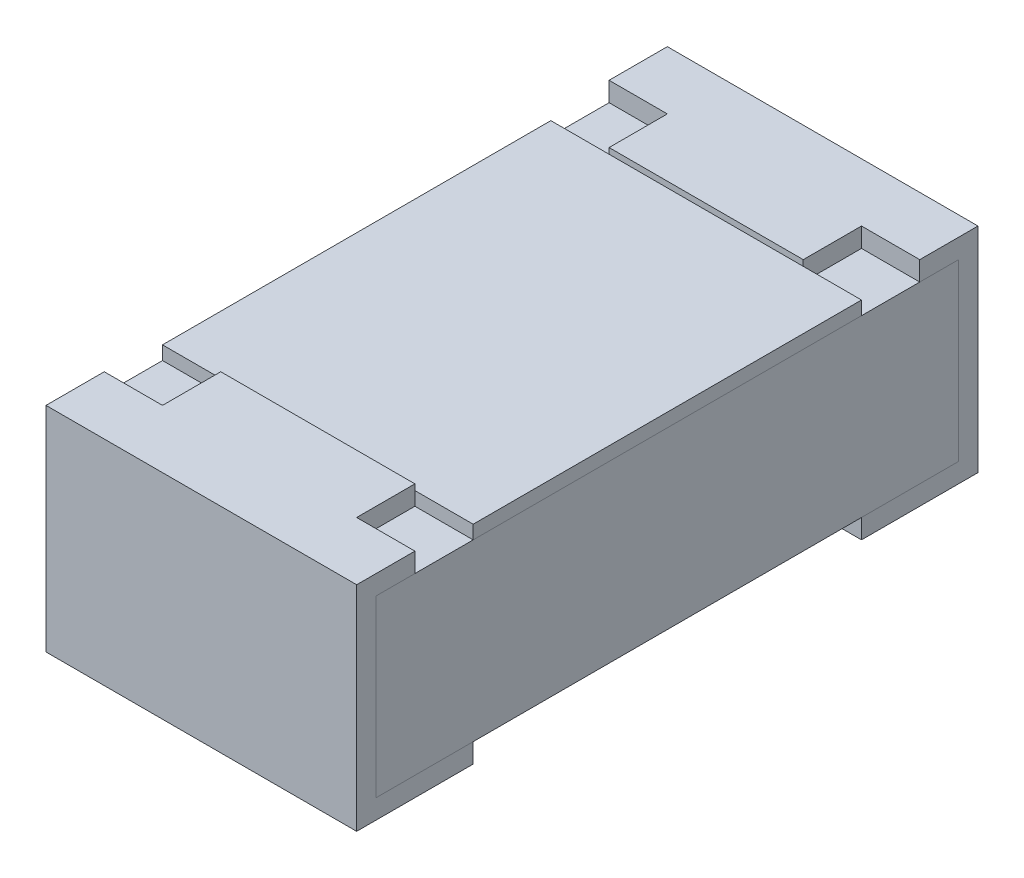
ISO-10303-21;
HEADER;
FILE_DESCRIPTION(('STEP AP214'),'2;1');
FILE_NAME('part.step','',(''),(''),'','','');
FILE_SCHEMA(('AUTOMOTIVE_DESIGN { 1 0 10303 214 1 1 1 1 }'));
ENDSEC;
DATA;
#1=APPLICATION_CONTEXT('core data for automotive mechanical design processes');
#2=APPLICATION_PROTOCOL_DEFINITION('international standard','automotive_design',2000,#1);
#3=PRODUCT_CONTEXT('',#1,'mechanical');
#4=PRODUCT('Part','Part','',(#3));
#5=PRODUCT_RELATED_PRODUCT_CATEGORY('part','',(#4));
#6=PRODUCT_DEFINITION_FORMATION('','',#4);
#7=PRODUCT_DEFINITION_CONTEXT('part definition',#1,'design');
#8=PRODUCT_DEFINITION('design','',#6,#7);
#9=PRODUCT_DEFINITION_SHAPE('','',#8);
#10=(LENGTH_UNIT() NAMED_UNIT(*) SI_UNIT(.MILLI.,.METRE.));
#11=(NAMED_UNIT(*) PLANE_ANGLE_UNIT() SI_UNIT($,.RADIAN.));
#12=(NAMED_UNIT(*) SI_UNIT($,.STERADIAN.) SOLID_ANGLE_UNIT());
#13=UNCERTAINTY_MEASURE_WITH_UNIT(LENGTH_MEASURE(1.E-05),#10,'distance_accuracy_value','');
#14=(GEOMETRIC_REPRESENTATION_CONTEXT(3) GLOBAL_UNCERTAINTY_ASSIGNED_CONTEXT((#13)) GLOBAL_UNIT_ASSIGNED_CONTEXT((#10,
#11,#12)) REPRESENTATION_CONTEXT('',''));
#15=CARTESIAN_POINT('',(0.,0.,0.));
#16=DIRECTION('',(0.,0.,1.));
#17=DIRECTION('',(1.,0.,0.));
#18=AXIS2_PLACEMENT_3D('',#15,#16,#17);
#19=CARTESIAN_POINT('',(-0.25,0.5,0.65));
#20=DIRECTION('',(1.,0.,0.));
#21=DIRECTION('',(0.,0.,-1.));
#22=AXIS2_PLACEMENT_3D('',#19,#20,#21);
#23=PLANE('',#22);
#24=DIRECTION('',(0.,0.,-1.));
#25=VECTOR('',#24,1.);
#26=CARTESIAN_POINT('',(-0.25,0.5,0.75));
#27=LINE('',#26,#25);
#28=CARTESIAN_POINT('',(-0.25,0.5,0.65));
#29=VERTEX_POINT('',#28);
#30=CARTESIAN_POINT('',(-0.25,0.5,0.5));
#31=VERTEX_POINT('',#30);
#32=EDGE_CURVE('P0_E110',#29,#31,#27,.T.);
#33=ORIENTED_EDGE('',*,*,#32,.F.);
#34=DIRECTION('',(0.,1.,0.));
#35=VECTOR('',#34,1.);
#36=CARTESIAN_POINT('',(-0.25,0.5,0.65));
#37=LINE('',#36,#35);
#38=CARTESIAN_POINT('',(-0.25,0.55,0.65));
#39=VERTEX_POINT('',#38);
#40=EDGE_CURVE('P0_E193',#29,#39,#37,.T.);
#41=ORIENTED_EDGE('',*,*,#40,.T.);
#42=DIRECTION('',(0.,0.,1.));
#43=VECTOR('',#42,1.);
#44=CARTESIAN_POINT('',(-0.25,0.55,0.5));
#45=LINE('',#44,#43);
#46=CARTESIAN_POINT('',(-0.25,0.55,0.5));
#47=VERTEX_POINT('',#46);
#48=EDGE_CURVE('P0_E113',#47,#39,#45,.T.);
#49=ORIENTED_EDGE('',*,*,#48,.F.);
#50=DIRECTION('',(0.,1.,0.));
#51=VECTOR('',#50,1.);
#52=CARTESIAN_POINT('',(-0.25,0.55,0.5));
#53=LINE('',#52,#51);
#54=EDGE_CURVE('P0_E108',#31,#47,#53,.T.);
#55=ORIENTED_EDGE('',*,*,#54,.F.);
#56=EDGE_LOOP('',(#33,#41,#49,#55));
#57=FACE_BOUND('',#56,.T.);
#58=ADVANCED_FACE('P0_F16',(#57),#23,.F.);
#59=CARTESIAN_POINT('',(0.4,0.5,0.65));
#60=DIRECTION('',(0.,0.,1.));
#61=DIRECTION('',(1.,0.,0.));
#62=AXIS2_PLACEMENT_3D('',#59,#60,#61);
#63=PLANE('',#62);
#64=DIRECTION('',(0.,1.,0.));
#65=VECTOR('',#64,1.);
#66=CARTESIAN_POINT('',(0.4,0.5,0.65));
#67=LINE('',#66,#65);
#68=CARTESIAN_POINT('',(0.4,0.5,0.65));
#69=VERTEX_POINT('',#68);
#70=CARTESIAN_POINT('',(0.4,0.55,0.65));
#71=VERTEX_POINT('',#70);
#72=EDGE_CURVE('P0_E189',#69,#71,#67,.T.);
#73=ORIENTED_EDGE('',*,*,#72,.F.);
#74=DIRECTION('',(1.,0.,0.));
#75=VECTOR('',#74,1.);
#76=CARTESIAN_POINT('',(-0.4,0.5,0.65));
#77=LINE('',#76,#75);
#78=CARTESIAN_POINT('',(0.25,0.5,0.65));
#79=VERTEX_POINT('',#78);
#80=EDGE_CURVE('P0_E199',#79,#69,#77,.T.);
#81=ORIENTED_EDGE('',*,*,#80,.F.);
#82=DIRECTION('',(0.,1.,0.));
#83=VECTOR('',#82,1.);
#84=CARTESIAN_POINT('',(0.25,0.5,0.65));
#85=LINE('',#84,#83);
#86=CARTESIAN_POINT('',(0.25,0.55,0.65));
#87=VERTEX_POINT('',#86);
#88=EDGE_CURVE('P0_E19',#79,#87,#85,.T.);
#89=ORIENTED_EDGE('',*,*,#88,.T.);
#90=DIRECTION('',(1.,0.,0.));
#91=VECTOR('',#90,1.);
#92=CARTESIAN_POINT('',(-0.4,0.55,0.65));
#93=LINE('',#92,#91);
#94=EDGE_CURVE('P0_E168',#71,#87,#93,.F.);
#95=ORIENTED_EDGE('',*,*,#94,.F.);
#96=EDGE_LOOP('',(#73,#81,#89,#95));
#97=FACE_BOUND('',#96,.T.);
#98=ADVANCED_FACE('P0_F208',(#97),#63,.F.);
#99=CARTESIAN_POINT('',(0.25,0.5,0.65));
#100=DIRECTION('',(-1.,0.,0.));
#101=DIRECTION('',(0.,0.,1.));
#102=AXIS2_PLACEMENT_3D('',#99,#100,#101);
#103=PLANE('',#102);
#104=DIRECTION('',(0.,0.,1.));
#105=VECTOR('',#104,1.);
#106=CARTESIAN_POINT('',(0.25,0.55,0.5));
#107=LINE('',#106,#105);
#108=CARTESIAN_POINT('',(0.25,0.55,0.5));
#109=VERTEX_POINT('',#108);
#110=EDGE_CURVE('P0_E165',#87,#109,#107,.F.);
#111=ORIENTED_EDGE('',*,*,#110,.F.);
#112=ORIENTED_EDGE('',*,*,#88,.F.);
#113=DIRECTION('',(0.,0.,-1.));
#114=VECTOR('',#113,1.);
#115=CARTESIAN_POINT('',(0.25,0.5,0.75));
#116=LINE('',#115,#114);
#117=CARTESIAN_POINT('',(0.25,0.5,0.5));
#118=VERTEX_POINT('',#117);
#119=EDGE_CURVE('P0_E120',#118,#79,#116,.F.);
#120=ORIENTED_EDGE('',*,*,#119,.F.);
#121=DIRECTION('',(0.,1.,0.));
#122=VECTOR('',#121,1.);
#123=CARTESIAN_POINT('',(0.25,0.55,0.5));
#124=LINE('',#123,#122);
#125=EDGE_CURVE('P0_E103',#109,#118,#124,.F.);
#126=ORIENTED_EDGE('',*,*,#125,.F.);
#127=EDGE_LOOP('',(#111,#112,#120,#126));
#128=FACE_BOUND('',#127,.T.);
#129=ADVANCED_FACE('P0_F205',(#128),#103,.F.);
#130=CARTESIAN_POINT('',(-0.4,0.55,0.5));
#131=DIRECTION('',(0.,0.,-1.));
#132=DIRECTION('',(-1.,0.,0.));
#133=AXIS2_PLACEMENT_3D('',#130,#131,#132);
#134=PLANE('',#133);
#135=ORIENTED_EDGE('',*,*,#125,.T.);
#136=DIRECTION('',(1.,0.,0.));
#137=VECTOR('',#136,1.);
#138=CARTESIAN_POINT('',(-0.4,0.5,0.5));
#139=LINE('',#138,#137);
#140=EDGE_CURVE('P0_E116',#31,#118,#139,.T.);
#141=ORIENTED_EDGE('',*,*,#140,.F.);
#142=ORIENTED_EDGE('',*,*,#54,.T.);
#143=DIRECTION('',(1.,0.,0.));
#144=VECTOR('',#143,1.);
#145=CARTESIAN_POINT('',(-0.4,0.55,0.5));
#146=LINE('',#145,#144);
#147=EDGE_CURVE('P0_E163',#109,#47,#146,.F.);
#148=ORIENTED_EDGE('',*,*,#147,.F.);
#149=EDGE_LOOP('',(#135,#141,#142,#148));
#150=FACE_BOUND('',#149,.T.);
#151=ADVANCED_FACE('P0_F117',(#150),#134,.T.);
#152=CARTESIAN_POINT('',(-0.4,0.,0.5));
#153=DIRECTION('',(0.,0.,-1.));
#154=DIRECTION('',(-1.,0.,0.));
#155=AXIS2_PLACEMENT_3D('',#152,#153,#154);
#156=PLANE('',#155);
#157=DIRECTION('',(1.,0.,0.));
#158=VECTOR('',#157,1.);
#159=CARTESIAN_POINT('',(-0.4,0.,0.5));
#160=LINE('',#159,#158);
#161=CARTESIAN_POINT('',(-0.4,0.,0.5));
#162=VERTEX_POINT('',#161);
#163=CARTESIAN_POINT('',(0.4,0.,0.5));
#164=VERTEX_POINT('',#163);
#165=EDGE_CURVE('P0_E191',#162,#164,#160,.T.);
#166=ORIENTED_EDGE('',*,*,#165,.F.);
#167=DIRECTION('',(0.,1.,0.));
#168=VECTOR('',#167,1.);
#169=CARTESIAN_POINT('',(-0.4,0.5,0.5));
#170=LINE('',#169,#168);
#171=CARTESIAN_POINT('',(-0.4,0.05,0.5));
#172=VERTEX_POINT('',#171);
#173=EDGE_CURVE('P0_E151',#162,#172,#170,.T.);
#174=ORIENTED_EDGE('',*,*,#173,.T.);
#175=DIRECTION('',(1.,0.,0.));
#176=VECTOR('',#175,1.);
#177=CARTESIAN_POINT('',(-0.4,0.05,0.5));
#178=LINE('',#177,#176);
#179=CARTESIAN_POINT('',(0.4,0.05,0.5));
#180=VERTEX_POINT('',#179);
#181=EDGE_CURVE('P0_E129',#180,#172,#178,.F.);
#182=ORIENTED_EDGE('',*,*,#181,.F.);
#183=DIRECTION('',(0.,1.,0.));
#184=VECTOR('',#183,1.);
#185=CARTESIAN_POINT('',(0.4,0.5,0.5));
#186=LINE('',#185,#184);
#187=EDGE_CURVE('P0_E184',#164,#180,#186,.T.);
#188=ORIENTED_EDGE('',*,*,#187,.F.);
#189=EDGE_LOOP('',(#166,#174,#182,#188));
#190=FACE_BOUND('',#189,.T.);
#191=ADVANCED_FACE('P0_F232',(#190),#156,.T.);
#192=CARTESIAN_POINT('',(-0.4,0.05,0.75));
#193=DIRECTION('',(0.,1.,0.));
#194=DIRECTION('',(0.,0.,1.));
#195=AXIS2_PLACEMENT_3D('',#192,#193,#194);
#196=PLANE('',#195);
#197=ORIENTED_EDGE('',*,*,#181,.T.);
#198=DIRECTION('',(0.,0.,-1.));
#199=VECTOR('',#198,1.);
#200=CARTESIAN_POINT('',(-0.4,0.05,0.5));
#201=LINE('',#200,#199);
#202=CARTESIAN_POINT('',(-0.4,0.05,0.75));
#203=VERTEX_POINT('',#202);
#204=EDGE_CURVE('P0_E139',#172,#203,#201,.F.);
#205=ORIENTED_EDGE('',*,*,#204,.T.);
#206=DIRECTION('',(-1.,0.,0.));
#207=VECTOR('',#206,1.);
#208=CARTESIAN_POINT('',(-0.4,0.05,0.75));
#209=LINE('',#208,#207);
#210=CARTESIAN_POINT('',(0.4,0.05,0.75));
#211=VERTEX_POINT('',#210);
#212=EDGE_CURVE('P0_E126',#211,#203,#209,.T.);
#213=ORIENTED_EDGE('',*,*,#212,.F.);
#214=DIRECTION('',(0.,0.,-1.));
#215=VECTOR('',#214,1.);
#216=CARTESIAN_POINT('',(0.4,0.05,0.5));
#217=LINE('',#216,#215);
#218=EDGE_CURVE('P0_E141',#180,#211,#217,.F.);
#219=ORIENTED_EDGE('',*,*,#218,.F.);
#220=EDGE_LOOP('',(#197,#205,#213,#219));
#221=FACE_BOUND('',#220,.T.);
#222=ADVANCED_FACE('P0_F138',(#221),#196,.T.);
#223=CARTESIAN_POINT('',(-0.4,0.5,0.75));
#224=DIRECTION('',(0.,0.,-1.));
#225=DIRECTION('',(-1.,0.,0.));
#226=AXIS2_PLACEMENT_3D('',#223,#224,#225);
#227=PLANE('',#226);
#228=ORIENTED_EDGE('',*,*,#212,.T.);
#229=DIRECTION('',(0.,1.,0.));
#230=VECTOR('',#229,1.);
#231=CARTESIAN_POINT('',(-0.4,0.5,0.75));
#232=LINE('',#231,#230);
#233=CARTESIAN_POINT('',(-0.4,0.5,0.75));
#234=VERTEX_POINT('',#233);
#235=EDGE_CURVE('P0_E153',#203,#234,#232,.T.);
#236=ORIENTED_EDGE('',*,*,#235,.T.);
#237=DIRECTION('',(1.,0.,0.));
#238=VECTOR('',#237,1.);
#239=CARTESIAN_POINT('',(-0.4,0.5,0.75));
#240=LINE('',#239,#238);
#241=CARTESIAN_POINT('',(0.4,0.5,0.75));
#242=VERTEX_POINT('',#241);
#243=EDGE_CURVE('P0_E196',#242,#234,#240,.F.);
#244=ORIENTED_EDGE('',*,*,#243,.F.);
#245=DIRECTION('',(0.,1.,0.));
#246=VECTOR('',#245,1.);
#247=CARTESIAN_POINT('',(0.4,0.5,0.75));
#248=LINE('',#247,#246);
#249=EDGE_CURVE('P0_E180',#211,#242,#248,.T.);
#250=ORIENTED_EDGE('',*,*,#249,.F.);
#251=EDGE_LOOP('',(#228,#236,#244,#250));
#252=FACE_BOUND('',#251,.T.);
#253=ADVANCED_FACE('P0_F240',(#252),#227,.T.);
#254=CARTESIAN_POINT('',(-0.4,0.5,0.75));
#255=DIRECTION('',(0.,-1.,0.));
#256=DIRECTION('',(0.,0.,-1.));
#257=AXIS2_PLACEMENT_3D('',#254,#255,#256);
#258=PLANE('',#257);
#259=DIRECTION('',(0.,0.,-1.));
#260=VECTOR('',#259,1.);
#261=CARTESIAN_POINT('',(-0.4,0.5,0.5));
#262=LINE('',#261,#260);
#263=CARTESIAN_POINT('',(-0.4,0.5,0.65));
#264=VERTEX_POINT('',#263);
#265=EDGE_CURVE('P0_E155',#234,#264,#262,.T.);
#266=ORIENTED_EDGE('',*,*,#265,.T.);
#267=DIRECTION('',(1.,0.,0.));
#268=VECTOR('',#267,1.);
#269=CARTESIAN_POINT('',(-0.4,0.5,0.65));
#270=LINE('',#269,#268);
#271=EDGE_CURVE('P0_E124',#264,#29,#270,.T.);
#272=ORIENTED_EDGE('',*,*,#271,.T.);
#273=ORIENTED_EDGE('',*,*,#32,.T.);
#274=ORIENTED_EDGE('',*,*,#140,.T.);
#275=ORIENTED_EDGE('',*,*,#119,.T.);
#276=ORIENTED_EDGE('',*,*,#80,.T.);
#277=DIRECTION('',(0.,0.,-1.));
#278=VECTOR('',#277,1.);
#279=CARTESIAN_POINT('',(0.4,0.5,0.5));
#280=LINE('',#279,#278);
#281=EDGE_CURVE('P0_E177',#242,#69,#280,.T.);
#282=ORIENTED_EDGE('',*,*,#281,.F.);
#283=ORIENTED_EDGE('',*,*,#243,.T.);
#284=EDGE_LOOP('',(#266,#272,#273,#274,#275,#276,#282,#283));
#285=FACE_BOUND('',#284,.T.);
#286=ADVANCED_FACE('P0_F122',(#285),#258,.T.);
#287=CARTESIAN_POINT('',(-0.4,0.5,0.65));
#288=DIRECTION('',(0.,0.,1.));
#289=DIRECTION('',(1.,0.,0.));
#290=AXIS2_PLACEMENT_3D('',#287,#288,#289);
#291=PLANE('',#290);
#292=ORIENTED_EDGE('',*,*,#40,.F.);
#293=ORIENTED_EDGE('',*,*,#271,.F.);
#294=DIRECTION('',(0.,1.,0.));
#295=VECTOR('',#294,1.);
#296=CARTESIAN_POINT('',(-0.4,0.5,0.65));
#297=LINE('',#296,#295);
#298=CARTESIAN_POINT('',(-0.4,0.55,0.65));
#299=VERTEX_POINT('',#298);
#300=EDGE_CURVE('P0_E214',#264,#299,#297,.T.);
#301=ORIENTED_EDGE('',*,*,#300,.T.);
#302=DIRECTION('',(1.,0.,0.));
#303=VECTOR('',#302,1.);
#304=CARTESIAN_POINT('',(-0.4,0.55,0.65));
#305=LINE('',#304,#303);
#306=EDGE_CURVE('P0_E174',#39,#299,#305,.F.);
#307=ORIENTED_EDGE('',*,*,#306,.F.);
#308=EDGE_LOOP('',(#292,#293,#301,#307));
#309=FACE_BOUND('',#308,.T.);
#310=ADVANCED_FACE('P0_F256',(#309),#291,.F.);
#311=CARTESIAN_POINT('',(-0.4,0.,0.8));
#312=DIRECTION('',(0.,-1.,0.));
#313=DIRECTION('',(0.,0.,-1.));
#314=AXIS2_PLACEMENT_3D('',#311,#312,#313);
#315=PLANE('',#314);
#316=DIRECTION('',(1.,0.,0.));
#317=VECTOR('',#316,1.);
#318=CARTESIAN_POINT('',(-0.4,0.,0.8));
#319=LINE('',#318,#317);
#320=CARTESIAN_POINT('',(-0.4,0.,0.8));
#321=VERTEX_POINT('',#320);
#322=CARTESIAN_POINT('',(0.4,0.,0.8));
#323=VERTEX_POINT('',#322);
#324=EDGE_CURVE('P0_E218',#321,#323,#319,.T.);
#325=ORIENTED_EDGE('',*,*,#324,.F.);
#326=DIRECTION('',(0.,0.,-1.));
#327=VECTOR('',#326,1.);
#328=CARTESIAN_POINT('',(-0.4,0.,0.5));
#329=LINE('',#328,#327);
#330=EDGE_CURVE('P0_E157',#321,#162,#329,.T.);
#331=ORIENTED_EDGE('',*,*,#330,.T.);
#332=ORIENTED_EDGE('',*,*,#165,.T.);
#333=DIRECTION('',(0.,0.,-1.));
#334=VECTOR('',#333,1.);
#335=CARTESIAN_POINT('',(0.4,0.,0.5));
#336=LINE('',#335,#334);
#337=EDGE_CURVE('P0_E186',#323,#164,#336,.T.);
#338=ORIENTED_EDGE('',*,*,#337,.F.);
#339=EDGE_LOOP('',(#325,#331,#332,#338));
#340=FACE_BOUND('',#339,.T.);
#341=ADVANCED_FACE('P0_F231',(#340),#315,.T.);
#342=CARTESIAN_POINT('',(0.4,0.5,0.5));
#343=DIRECTION('',(1.,0.,0.));
#344=DIRECTION('',(0.,0.,-1.));
#345=AXIS2_PLACEMENT_3D('',#342,#343,#344);
#346=PLANE('',#345);
#347=ORIENTED_EDGE('',*,*,#249,.T.);
#348=ORIENTED_EDGE('',*,*,#281,.T.);
#349=ORIENTED_EDGE('',*,*,#72,.T.);
#350=DIRECTION('',(0.,0.,1.));
#351=VECTOR('',#350,1.);
#352=CARTESIAN_POINT('',(0.4,0.55,0.5));
#353=LINE('',#352,#351);
#354=CARTESIAN_POINT('',(0.4,0.55,0.8));
#355=VERTEX_POINT('',#354);
#356=EDGE_CURVE('P0_E171',#355,#71,#353,.F.);
#357=ORIENTED_EDGE('',*,*,#356,.F.);
#358=DIRECTION('',(0.,1.,0.));
#359=VECTOR('',#358,1.);
#360=CARTESIAN_POINT('',(0.4,0.55,0.8));
#361=LINE('',#360,#359);
#362=EDGE_CURVE('P0_E221',#323,#355,#361,.T.);
#363=ORIENTED_EDGE('',*,*,#362,.F.);
#364=ORIENTED_EDGE('',*,*,#337,.T.);
#365=ORIENTED_EDGE('',*,*,#187,.T.);
#366=ORIENTED_EDGE('',*,*,#218,.T.);
#367=EDGE_LOOP('',(#347,#348,#349,#357,#363,#364,#365,#366));
#368=FACE_BOUND('',#367,.T.);
#369=ADVANCED_FACE('P0_F210',(#368),#346,.T.);
#370=CARTESIAN_POINT('',(-0.4,0.55,0.5));
#371=DIRECTION('',(0.,1.,0.));
#372=DIRECTION('',(0.,0.,1.));
#373=AXIS2_PLACEMENT_3D('',#370,#371,#372);
#374=PLANE('',#373);
#375=ORIENTED_EDGE('',*,*,#110,.T.);
#376=ORIENTED_EDGE('',*,*,#147,.T.);
#377=ORIENTED_EDGE('',*,*,#48,.T.);
#378=ORIENTED_EDGE('',*,*,#306,.T.);
#379=DIRECTION('',(0.,0.,-1.));
#380=VECTOR('',#379,1.);
#381=CARTESIAN_POINT('',(-0.4,0.55,0.5));
#382=LINE('',#381,#380);
#383=CARTESIAN_POINT('',(-0.4,0.55,0.8));
#384=VERTEX_POINT('',#383);
#385=EDGE_CURVE('P0_E34',#299,#384,#382,.F.);
#386=ORIENTED_EDGE('',*,*,#385,.T.);
#387=DIRECTION('',(1.,0.,0.));
#388=VECTOR('',#387,1.);
#389=CARTESIAN_POINT('',(-0.4,0.55,0.8));
#390=LINE('',#389,#388);
#391=EDGE_CURVE('P0_E25',#355,#384,#390,.F.);
#392=ORIENTED_EDGE('',*,*,#391,.F.);
#393=ORIENTED_EDGE('',*,*,#356,.T.);
#394=ORIENTED_EDGE('',*,*,#94,.T.);
#395=EDGE_LOOP('',(#375,#376,#377,#378,#386,#392,#393,#394));
#396=FACE_BOUND('',#395,.T.);
#397=ADVANCED_FACE('P0_F227',(#396),#374,.T.);
#398=CARTESIAN_POINT('',(-0.4,0.5,0.5));
#399=DIRECTION('',(1.,0.,0.));
#400=DIRECTION('',(0.,0.,-1.));
#401=AXIS2_PLACEMENT_3D('',#398,#399,#400);
#402=PLANE('',#401);
#403=ORIENTED_EDGE('',*,*,#300,.F.);
#404=ORIENTED_EDGE('',*,*,#265,.F.);
#405=ORIENTED_EDGE('',*,*,#235,.F.);
#406=ORIENTED_EDGE('',*,*,#204,.F.);
#407=ORIENTED_EDGE('',*,*,#173,.F.);
#408=ORIENTED_EDGE('',*,*,#330,.F.);
#409=DIRECTION('',(0.,1.,0.));
#410=VECTOR('',#409,1.);
#411=CARTESIAN_POINT('',(-0.4,0.55,0.8));
#412=LINE('',#411,#410);
#413=EDGE_CURVE('P0_E11',#384,#321,#412,.F.);
#414=ORIENTED_EDGE('',*,*,#413,.F.);
#415=ORIENTED_EDGE('',*,*,#385,.F.);
#416=EDGE_LOOP('',(#403,#404,#405,#406,#407,#408,#414,#415));
#417=FACE_BOUND('',#416,.T.);
#418=ADVANCED_FACE('P0_F149',(#417),#402,.F.);
#419=CARTESIAN_POINT('',(-0.4,0.55,0.8));
#420=DIRECTION('',(0.,0.,1.));
#421=DIRECTION('',(1.,0.,0.));
#422=AXIS2_PLACEMENT_3D('',#419,#420,#421);
#423=PLANE('',#422);
#424=ORIENTED_EDGE('',*,*,#391,.T.);
#425=ORIENTED_EDGE('',*,*,#413,.T.);
#426=ORIENTED_EDGE('',*,*,#324,.T.);
#427=ORIENTED_EDGE('',*,*,#362,.T.);
#428=EDGE_LOOP('',(#424,#425,#426,#427));
#429=FACE_BOUND('',#428,.T.);
#430=ADVANCED_FACE('P0_F226',(#429),#423,.T.);
#431=CLOSED_SHELL('',(#58,#98,#129,#151,#191,#222,#253,#286,#310,#341,#369,#397,#418,#430));
#432=MANIFOLD_SOLID_BREP('P0_B1',#431);
#433=CARTESIAN_POINT('',(-0.4,0.5,0.5));
#434=DIRECTION('',(0.,-1.,0.));
#435=DIRECTION('',(0.,0.,-1.));
#436=AXIS2_PLACEMENT_3D('',#433,#434,#435);
#437=PLANE('',#436);
#438=DIRECTION('',(1.,0.,0.));
#439=VECTOR('',#438,1.);
#440=CARTESIAN_POINT('',(-0.4,0.5,0.5));
#441=LINE('',#440,#439);
#442=CARTESIAN_POINT('',(-0.4,0.5,0.5));
#443=VERTEX_POINT('',#442);
#444=CARTESIAN_POINT('',(0.4,0.5,0.5));
#445=VERTEX_POINT('',#444);
#446=EDGE_CURVE('P1_E19',#443,#445,#441,.T.);
#447=ORIENTED_EDGE('',*,*,#446,.F.);
#448=DIRECTION('',(0.,0.,-1.));
#449=VECTOR('',#448,1.);
#450=CARTESIAN_POINT('',(-0.4,0.5,0.5));
#451=LINE('',#450,#449);
#452=CARTESIAN_POINT('',(-0.4,0.5,-0.5));
#453=VERTEX_POINT('',#452);
#454=EDGE_CURVE('P1_E78',#443,#453,#451,.T.);
#455=ORIENTED_EDGE('',*,*,#454,.T.);
#456=DIRECTION('',(-1.,0.,0.));
#457=VECTOR('',#456,1.);
#458=CARTESIAN_POINT('',(-0.4,0.5,-0.5));
#459=LINE('',#458,#457);
#460=CARTESIAN_POINT('',(0.4,0.5,-0.5));
#461=VERTEX_POINT('',#460);
#462=EDGE_CURVE('P1_E67',#461,#453,#459,.T.);
#463=ORIENTED_EDGE('',*,*,#462,.F.);
#464=DIRECTION('',(0.,0.,-1.));
#465=VECTOR('',#464,1.);
#466=CARTESIAN_POINT('',(0.4,0.5,0.5));
#467=LINE('',#466,#465);
#468=EDGE_CURVE('P1_E55',#445,#461,#467,.T.);
#469=ORIENTED_EDGE('',*,*,#468,.F.);
#470=EDGE_LOOP('',(#447,#455,#463,#469));
#471=FACE_BOUND('',#470,.T.);
#472=ADVANCED_FACE('P1_F16',(#471),#437,.T.);
#473=CARTESIAN_POINT('',(-0.4,0.535,0.5));
#474=DIRECTION('',(0.,0.,1.));
#475=DIRECTION('',(1.,0.,0.));
#476=AXIS2_PLACEMENT_3D('',#473,#474,#475);
#477=PLANE('',#476);
#478=DIRECTION('',(1.,0.,0.));
#479=VECTOR('',#478,1.);
#480=CARTESIAN_POINT('',(-0.4,0.535,0.5));
#481=LINE('',#480,#479);
#482=CARTESIAN_POINT('',(-0.4,0.535,0.5));
#483=VERTEX_POINT('',#482);
#484=CARTESIAN_POINT('',(0.4,0.535,0.5));
#485=VERTEX_POINT('',#484);
#486=EDGE_CURVE('P1_E82',#483,#485,#481,.T.);
#487=ORIENTED_EDGE('',*,*,#486,.F.);
#488=DIRECTION('',(0.,1.,0.));
#489=VECTOR('',#488,1.);
#490=CARTESIAN_POINT('',(-0.4,0.5,0.5));
#491=LINE('',#490,#489);
#492=EDGE_CURVE('P1_E64',#483,#443,#491,.F.);
#493=ORIENTED_EDGE('',*,*,#492,.T.);
#494=ORIENTED_EDGE('',*,*,#446,.T.);
#495=DIRECTION('',(0.,1.,0.));
#496=VECTOR('',#495,1.);
#497=CARTESIAN_POINT('',(0.4,0.5,0.5));
#498=LINE('',#497,#496);
#499=EDGE_CURVE('P1_E61',#485,#445,#498,.F.);
#500=ORIENTED_EDGE('',*,*,#499,.F.);
#501=EDGE_LOOP('',(#487,#493,#494,#500));
#502=FACE_BOUND('',#501,.T.);
#503=ADVANCED_FACE('P1_F60',(#502),#477,.T.);
#504=CARTESIAN_POINT('',(0.4,0.5,0.5));
#505=DIRECTION('',(1.,0.,0.));
#506=DIRECTION('',(0.,0.,-1.));
#507=AXIS2_PLACEMENT_3D('',#504,#505,#506);
#508=PLANE('',#507);
#509=DIRECTION('',(0.,1.,0.));
#510=VECTOR('',#509,1.);
#511=CARTESIAN_POINT('',(0.4,0.535,-0.5));
#512=LINE('',#511,#510);
#513=CARTESIAN_POINT('',(0.4,0.535,-0.5));
#514=VERTEX_POINT('',#513);
#515=EDGE_CURVE('P1_E69',#514,#461,#512,.F.);
#516=ORIENTED_EDGE('',*,*,#515,.F.);
#517=DIRECTION('',(0.,0.,1.));
#518=VECTOR('',#517,1.);
#519=CARTESIAN_POINT('',(0.4,0.535,0.5));
#520=LINE('',#519,#518);
#521=EDGE_CURVE('P1_E73',#485,#514,#520,.F.);
#522=ORIENTED_EDGE('',*,*,#521,.F.);
#523=ORIENTED_EDGE('',*,*,#499,.T.);
#524=ORIENTED_EDGE('',*,*,#468,.T.);
#525=EDGE_LOOP('',(#516,#522,#523,#524));
#526=FACE_BOUND('',#525,.T.);
#527=ADVANCED_FACE('P1_F71',(#526),#508,.T.);
#528=CARTESIAN_POINT('',(-0.4,0.535,-0.5));
#529=DIRECTION('',(0.,0.,-1.));
#530=DIRECTION('',(-1.,0.,0.));
#531=AXIS2_PLACEMENT_3D('',#528,#529,#530);
#532=PLANE('',#531);
#533=ORIENTED_EDGE('',*,*,#462,.T.);
#534=DIRECTION('',(0.,1.,0.));
#535=VECTOR('',#534,1.);
#536=CARTESIAN_POINT('',(-0.4,0.5,-0.5));
#537=LINE('',#536,#535);
#538=CARTESIAN_POINT('',(-0.4,0.535,-0.5));
#539=VERTEX_POINT('',#538);
#540=EDGE_CURVE('P1_E34',#453,#539,#537,.T.);
#541=ORIENTED_EDGE('',*,*,#540,.T.);
#542=DIRECTION('',(1.,0.,0.));
#543=VECTOR('',#542,1.);
#544=CARTESIAN_POINT('',(-0.4,0.535,-0.5));
#545=LINE('',#544,#543);
#546=EDGE_CURVE('P1_E25',#514,#539,#545,.F.);
#547=ORIENTED_EDGE('',*,*,#546,.F.);
#548=ORIENTED_EDGE('',*,*,#515,.T.);
#549=EDGE_LOOP('',(#533,#541,#547,#548));
#550=FACE_BOUND('',#549,.T.);
#551=ADVANCED_FACE('P1_F88',(#550),#532,.T.);
#552=CARTESIAN_POINT('',(-0.4,0.5,0.5));
#553=DIRECTION('',(1.,0.,0.));
#554=DIRECTION('',(0.,0.,-1.));
#555=AXIS2_PLACEMENT_3D('',#552,#553,#554);
#556=PLANE('',#555);
#557=DIRECTION('',(0.,0.,1.));
#558=VECTOR('',#557,1.);
#559=CARTESIAN_POINT('',(-0.4,0.535,0.5));
#560=LINE('',#559,#558);
#561=EDGE_CURVE('P1_E11',#539,#483,#560,.T.);
#562=ORIENTED_EDGE('',*,*,#561,.F.);
#563=ORIENTED_EDGE('',*,*,#540,.F.);
#564=ORIENTED_EDGE('',*,*,#454,.F.);
#565=ORIENTED_EDGE('',*,*,#492,.F.);
#566=EDGE_LOOP('',(#562,#563,#564,#565));
#567=FACE_BOUND('',#566,.T.);
#568=ADVANCED_FACE('P1_F90',(#567),#556,.F.);
#569=CARTESIAN_POINT('',(-0.4,0.535,0.5));
#570=DIRECTION('',(0.,1.,0.));
#571=DIRECTION('',(0.,0.,1.));
#572=AXIS2_PLACEMENT_3D('',#569,#570,#571);
#573=PLANE('',#572);
#574=ORIENTED_EDGE('',*,*,#546,.T.);
#575=ORIENTED_EDGE('',*,*,#561,.T.);
#576=ORIENTED_EDGE('',*,*,#486,.T.);
#577=ORIENTED_EDGE('',*,*,#521,.T.);
#578=EDGE_LOOP('',(#574,#575,#576,#577));
#579=FACE_BOUND('',#578,.T.);
#580=ADVANCED_FACE('P1_F87',(#579),#573,.T.);
#581=CLOSED_SHELL('',(#472,#503,#527,#551,#568,#580));
#582=MANIFOLD_SOLID_BREP('P1_B1',#581);
#583=CARTESIAN_POINT('',(-0.25,0.5,0.65));
#584=DIRECTION('',(1.,0.,0.));
#585=DIRECTION('',(0.,0.,-1.));
#586=AXIS2_PLACEMENT_3D('',#583,#584,#585);
#587=PLANE('',#586);
#588=DIRECTION('',(0.,0.,1.));
#589=VECTOR('',#588,1.);
#590=CARTESIAN_POINT('',(-0.25,0.55,-0.5));
#591=LINE('',#590,#589);
#592=CARTESIAN_POINT('',(-0.25,0.55,-0.65));
#593=VERTEX_POINT('',#592);
#594=CARTESIAN_POINT('',(-0.25,0.55,-0.5));
#595=VERTEX_POINT('',#594);
#596=EDGE_CURVE('P2_E113',#593,#595,#591,.T.);
#597=ORIENTED_EDGE('',*,*,#596,.F.);
#598=DIRECTION('',(0.,1.,0.));
#599=VECTOR('',#598,1.);
#600=CARTESIAN_POINT('',(-0.25,0.5,-0.65));
#601=LINE('',#600,#599);
#602=CARTESIAN_POINT('',(-0.25,0.5,-0.65));
#603=VERTEX_POINT('',#602);
#604=EDGE_CURVE('P2_E107',#593,#603,#601,.F.);
#605=ORIENTED_EDGE('',*,*,#604,.T.);
#606=DIRECTION('',(0.,0.,-1.));
#607=VECTOR('',#606,1.);
#608=CARTESIAN_POINT('',(-0.25,0.5,-0.75));
#609=LINE('',#608,#607);
#610=CARTESIAN_POINT('',(-0.25,0.5,-0.5));
#611=VERTEX_POINT('',#610);
#612=EDGE_CURVE('P2_E110',#611,#603,#609,.T.);
#613=ORIENTED_EDGE('',*,*,#612,.F.);
#614=DIRECTION('',(0.,1.,0.));
#615=VECTOR('',#614,1.);
#616=CARTESIAN_POINT('',(-0.25,0.55,-0.5));
#617=LINE('',#616,#615);
#618=EDGE_CURVE('P2_E19',#595,#611,#617,.F.);
#619=ORIENTED_EDGE('',*,*,#618,.F.);
#620=EDGE_LOOP('',(#597,#605,#613,#619));
#621=FACE_BOUND('',#620,.T.);
#622=ADVANCED_FACE('P2_F16',(#621),#587,.F.);
#623=CARTESIAN_POINT('',(-0.4,0.55,-0.5));
#624=DIRECTION('',(0.,0.,1.));
#625=DIRECTION('',(1.,0.,0.));
#626=AXIS2_PLACEMENT_3D('',#623,#624,#625);
#627=PLANE('',#626);
#628=DIRECTION('',(0.,1.,0.));
#629=VECTOR('',#628,1.);
#630=CARTESIAN_POINT('',(0.25,0.5,-0.5));
#631=LINE('',#630,#629);
#632=CARTESIAN_POINT('',(0.25,0.5,-0.5));
#633=VERTEX_POINT('',#632);
#634=CARTESIAN_POINT('',(0.25,0.55,-0.5));
#635=VERTEX_POINT('',#634);
#636=EDGE_CURVE('P2_E150',#633,#635,#631,.T.);
#637=ORIENTED_EDGE('',*,*,#636,.T.);
#638=DIRECTION('',(1.,0.,0.));
#639=VECTOR('',#638,1.);
#640=CARTESIAN_POINT('',(-0.4,0.55,-0.5));
#641=LINE('',#640,#639);
#642=EDGE_CURVE('P2_E156',#595,#635,#641,.T.);
#643=ORIENTED_EDGE('',*,*,#642,.F.);
#644=ORIENTED_EDGE('',*,*,#618,.T.);
#645=DIRECTION('',(1.,0.,0.));
#646=VECTOR('',#645,1.);
#647=CARTESIAN_POINT('',(-0.4,0.5,-0.5));
#648=LINE('',#647,#646);
#649=EDGE_CURVE('P2_E132',#633,#611,#648,.F.);
#650=ORIENTED_EDGE('',*,*,#649,.F.);
#651=EDGE_LOOP('',(#637,#643,#644,#650));
#652=FACE_BOUND('',#651,.T.);
#653=ADVANCED_FACE('P2_F154',(#652),#627,.T.);
#654=CARTESIAN_POINT('',(0.25,0.5,0.65));
#655=DIRECTION('',(-1.,0.,0.));
#656=DIRECTION('',(0.,0.,1.));
#657=AXIS2_PLACEMENT_3D('',#654,#655,#656);
#658=PLANE('',#657);
#659=DIRECTION('',(0.,0.,-1.));
#660=VECTOR('',#659,1.);
#661=CARTESIAN_POINT('',(0.25,0.5,-0.75));
#662=LINE('',#661,#660);
#663=CARTESIAN_POINT('',(0.25,0.5,-0.65));
#664=VERTEX_POINT('',#663);
#665=EDGE_CURVE('P2_E136',#664,#633,#662,.F.);
#666=ORIENTED_EDGE('',*,*,#665,.F.);
#667=DIRECTION('',(0.,1.,0.));
#668=VECTOR('',#667,1.);
#669=CARTESIAN_POINT('',(0.25,0.5,-0.65));
#670=LINE('',#669,#668);
#671=CARTESIAN_POINT('',(0.25,0.55,-0.65));
#672=VERTEX_POINT('',#671);
#673=EDGE_CURVE('P2_E101',#664,#672,#670,.T.);
#674=ORIENTED_EDGE('',*,*,#673,.T.);
#675=DIRECTION('',(0.,0.,1.));
#676=VECTOR('',#675,1.);
#677=CARTESIAN_POINT('',(0.25,0.55,-0.5));
#678=LINE('',#677,#676);
#679=EDGE_CURVE('P2_E159',#635,#672,#678,.F.);
#680=ORIENTED_EDGE('',*,*,#679,.F.);
#681=ORIENTED_EDGE('',*,*,#636,.F.);
#682=EDGE_LOOP('',(#666,#674,#680,#681));
#683=FACE_BOUND('',#682,.T.);
#684=ADVANCED_FACE('P2_F325',(#683),#658,.F.);
#685=CARTESIAN_POINT('',(0.4,0.5,-0.65));
#686=DIRECTION('',(0.,0.,-1.));
#687=DIRECTION('',(-1.,0.,0.));
#688=AXIS2_PLACEMENT_3D('',#685,#686,#687);
#689=PLANE('',#688);
#690=ORIENTED_EDGE('',*,*,#673,.F.);
#691=DIRECTION('',(1.,0.,0.));
#692=VECTOR('',#691,1.);
#693=CARTESIAN_POINT('',(-0.4,0.5,-0.65));
#694=LINE('',#693,#692);
#695=CARTESIAN_POINT('',(0.4,0.5,-0.65));
#696=VERTEX_POINT('',#695);
#697=EDGE_CURVE('P2_E141',#696,#664,#694,.F.);
#698=ORIENTED_EDGE('',*,*,#697,.F.);
#699=DIRECTION('',(0.,1.,0.));
#700=VECTOR('',#699,1.);
#701=CARTESIAN_POINT('',(0.4,0.,-0.65));
#702=LINE('',#701,#700);
#703=CARTESIAN_POINT('',(0.4,0.55,-0.65));
#704=VERTEX_POINT('',#703);
#705=EDGE_CURVE('P2_E177',#696,#704,#702,.T.);
#706=ORIENTED_EDGE('',*,*,#705,.T.);
#707=DIRECTION('',(1.,0.,0.));
#708=VECTOR('',#707,1.);
#709=CARTESIAN_POINT('',(-0.4,0.55,-0.65));
#710=LINE('',#709,#708);
#711=EDGE_CURVE('P2_E165',#672,#704,#710,.T.);
#712=ORIENTED_EDGE('',*,*,#711,.F.);
#713=EDGE_LOOP('',(#690,#698,#706,#712));
#714=FACE_BOUND('',#713,.T.);
#715=ADVANCED_FACE('P2_F227',(#714),#689,.F.);
#716=CARTESIAN_POINT('',(-0.4,0.5,-0.65));
#717=DIRECTION('',(0.,0.,-1.));
#718=DIRECTION('',(-1.,0.,0.));
#719=AXIS2_PLACEMENT_3D('',#716,#717,#718);
#720=PLANE('',#719);
#721=DIRECTION('',(0.,1.,0.));
#722=VECTOR('',#721,1.);
#723=CARTESIAN_POINT('',(-0.4,0.,-0.65));
#724=LINE('',#723,#722);
#725=CARTESIAN_POINT('',(-0.4,0.5,-0.65));
#726=VERTEX_POINT('',#725);
#727=CARTESIAN_POINT('',(-0.4,0.55,-0.65));
#728=VERTEX_POINT('',#727);
#729=EDGE_CURVE('P2_E122',#726,#728,#724,.T.);
#730=ORIENTED_EDGE('',*,*,#729,.F.);
#731=DIRECTION('',(1.,0.,0.));
#732=VECTOR('',#731,1.);
#733=CARTESIAN_POINT('',(-0.4,0.5,-0.65));
#734=LINE('',#733,#732);
#735=EDGE_CURVE('P2_E119',#603,#726,#734,.F.);
#736=ORIENTED_EDGE('',*,*,#735,.F.);
#737=ORIENTED_EDGE('',*,*,#604,.F.);
#738=DIRECTION('',(1.,0.,0.));
#739=VECTOR('',#738,1.);
#740=CARTESIAN_POINT('',(-0.4,0.55,-0.65));
#741=LINE('',#740,#739);
#742=EDGE_CURVE('P2_E133',#728,#593,#741,.T.);
#743=ORIENTED_EDGE('',*,*,#742,.F.);
#744=EDGE_LOOP('',(#730,#736,#737,#743));
#745=FACE_BOUND('',#744,.T.);
#746=ADVANCED_FACE('P2_F120',(#745),#720,.F.);
#747=CARTESIAN_POINT('',(-0.4,0.,-0.5));
#748=DIRECTION('',(0.,0.,1.));
#749=DIRECTION('',(1.,0.,0.));
#750=AXIS2_PLACEMENT_3D('',#747,#748,#749);
#751=PLANE('',#750);
#752=DIRECTION('',(1.,0.,0.));
#753=VECTOR('',#752,1.);
#754=CARTESIAN_POINT('',(-0.4,0.05,-0.5));
#755=LINE('',#754,#753);
#756=CARTESIAN_POINT('',(-0.4,0.05,-0.5));
#757=VERTEX_POINT('',#756);
#758=CARTESIAN_POINT('',(0.4,0.05,-0.5));
#759=VERTEX_POINT('',#758);
#760=EDGE_CURVE('P2_E116',#757,#759,#755,.T.);
#761=ORIENTED_EDGE('',*,*,#760,.F.);
#762=DIRECTION('',(0.,1.,0.));
#763=VECTOR('',#762,1.);
#764=CARTESIAN_POINT('',(-0.4,0.,-0.5));
#765=LINE('',#764,#763);
#766=CARTESIAN_POINT('',(-0.4,0.,-0.5));
#767=VERTEX_POINT('',#766);
#768=EDGE_CURVE('P2_E191',#767,#757,#765,.T.);
#769=ORIENTED_EDGE('',*,*,#768,.F.);
#770=DIRECTION('',(1.,0.,0.));
#771=VECTOR('',#770,1.);
#772=CARTESIAN_POINT('',(-0.4,0.,-0.5));
#773=LINE('',#772,#771);
#774=CARTESIAN_POINT('',(0.4,0.,-0.5));
#775=VERTEX_POINT('',#774);
#776=EDGE_CURVE('P2_E184',#775,#767,#773,.F.);
#777=ORIENTED_EDGE('',*,*,#776,.F.);
#778=DIRECTION('',(0.,1.,0.));
#779=VECTOR('',#778,1.);
#780=CARTESIAN_POINT('',(0.4,0.,-0.5));
#781=LINE('',#780,#779);
#782=EDGE_CURVE('P2_E168',#775,#759,#781,.T.);
#783=ORIENTED_EDGE('',*,*,#782,.T.);
#784=EDGE_LOOP('',(#761,#769,#777,#783));
#785=FACE_BOUND('',#784,.T.);
#786=ADVANCED_FACE('P2_F222',(#785),#751,.T.);
#787=CARTESIAN_POINT('',(-0.4,0.05,-0.75));
#788=DIRECTION('',(0.,1.,0.));
#789=DIRECTION('',(0.,0.,1.));
#790=AXIS2_PLACEMENT_3D('',#787,#788,#789);
#791=PLANE('',#790);
#792=DIRECTION('',(1.,0.,0.));
#793=VECTOR('',#792,1.);
#794=CARTESIAN_POINT('',(-0.4,0.05,-0.75));
#795=LINE('',#794,#793);
#796=CARTESIAN_POINT('',(-0.4,0.05,-0.75));
#797=VERTEX_POINT('',#796);
#798=CARTESIAN_POINT('',(0.4,0.05,-0.75));
#799=VERTEX_POINT('',#798);
#800=EDGE_CURVE('P2_E127',#797,#799,#795,.T.);
#801=ORIENTED_EDGE('',*,*,#800,.F.);
#802=DIRECTION('',(0.,0.,1.));
#803=VECTOR('',#802,1.);
#804=CARTESIAN_POINT('',(-0.4,0.05,-0.5));
#805=LINE('',#804,#803);
#806=EDGE_CURVE('P2_E194',#757,#797,#805,.F.);
#807=ORIENTED_EDGE('',*,*,#806,.F.);
#808=ORIENTED_EDGE('',*,*,#760,.T.);
#809=DIRECTION('',(0.,0.,1.));
#810=VECTOR('',#809,1.);
#811=CARTESIAN_POINT('',(0.4,0.05,-0.5));
#812=LINE('',#811,#810);
#813=EDGE_CURVE('P2_E170',#759,#799,#812,.F.);
#814=ORIENTED_EDGE('',*,*,#813,.T.);
#815=EDGE_LOOP('',(#801,#807,#808,#814));
#816=FACE_BOUND('',#815,.T.);
#817=ADVANCED_FACE('P2_F232',(#816),#791,.T.);
#818=CARTESIAN_POINT('',(-0.4,0.5,-0.75));
#819=DIRECTION('',(0.,0.,1.));
#820=DIRECTION('',(1.,0.,0.));
#821=AXIS2_PLACEMENT_3D('',#818,#819,#820);
#822=PLANE('',#821);
#823=DIRECTION('',(1.,0.,0.));
#824=VECTOR('',#823,1.);
#825=CARTESIAN_POINT('',(-0.4,0.5,-0.75));
#826=LINE('',#825,#824);
#827=CARTESIAN_POINT('',(-0.4,0.5,-0.75));
#828=VERTEX_POINT('',#827);
#829=CARTESIAN_POINT('',(0.4,0.5,-0.75));
#830=VERTEX_POINT('',#829);
#831=EDGE_CURVE('P2_E126',#828,#830,#826,.T.);
#832=ORIENTED_EDGE('',*,*,#831,.F.);
#833=DIRECTION('',(0.,1.,0.));
#834=VECTOR('',#833,1.);
#835=CARTESIAN_POINT('',(-0.4,0.,-0.75));
#836=LINE('',#835,#834);
#837=EDGE_CURVE('P2_E197',#797,#828,#836,.T.);
#838=ORIENTED_EDGE('',*,*,#837,.F.);
#839=ORIENTED_EDGE('',*,*,#800,.T.);
#840=DIRECTION('',(0.,1.,0.));
#841=VECTOR('',#840,1.);
#842=CARTESIAN_POINT('',(0.4,0.,-0.75));
#843=LINE('',#842,#841);
#844=EDGE_CURVE('P2_E172',#799,#830,#843,.T.);
#845=ORIENTED_EDGE('',*,*,#844,.T.);
#846=EDGE_LOOP('',(#832,#838,#839,#845));
#847=FACE_BOUND('',#846,.T.);
#848=ADVANCED_FACE('P2_F230',(#847),#822,.T.);
#849=CARTESIAN_POINT('',(-0.4,0.5,-0.75));
#850=DIRECTION('',(0.,-1.,0.));
#851=DIRECTION('',(0.,0.,-1.));
#852=AXIS2_PLACEMENT_3D('',#849,#850,#851);
#853=PLANE('',#852);
#854=ORIENTED_EDGE('',*,*,#649,.T.);
#855=ORIENTED_EDGE('',*,*,#612,.T.);
#856=ORIENTED_EDGE('',*,*,#735,.T.);
#857=DIRECTION('',(0.,0.,1.));
#858=VECTOR('',#857,1.);
#859=CARTESIAN_POINT('',(-0.4,0.5,-0.5));
#860=LINE('',#859,#858);
#861=EDGE_CURVE('P2_E200',#828,#726,#860,.T.);
#862=ORIENTED_EDGE('',*,*,#861,.F.);
#863=ORIENTED_EDGE('',*,*,#831,.T.);
#864=DIRECTION('',(0.,0.,1.));
#865=VECTOR('',#864,1.);
#866=CARTESIAN_POINT('',(0.4,0.5,-0.5));
#867=LINE('',#866,#865);
#868=EDGE_CURVE('P2_E174',#830,#696,#867,.T.);
#869=ORIENTED_EDGE('',*,*,#868,.T.);
#870=ORIENTED_EDGE('',*,*,#697,.T.);
#871=ORIENTED_EDGE('',*,*,#665,.T.);
#872=EDGE_LOOP('',(#854,#855,#856,#862,#863,#869,#870,#871));
#873=FACE_BOUND('',#872,.T.);
#874=ADVANCED_FACE('P2_F129',(#873),#853,.T.);
#875=CARTESIAN_POINT('',(-0.4,0.55,-0.5));
#876=DIRECTION('',(0.,1.,0.));
#877=DIRECTION('',(0.,0.,1.));
#878=AXIS2_PLACEMENT_3D('',#875,#876,#877);
#879=PLANE('',#878);
#880=DIRECTION('',(-1.,0.,0.));
#881=VECTOR('',#880,1.);
#882=CARTESIAN_POINT('',(-0.4,0.55,-0.8));
#883=LINE('',#882,#881);
#884=CARTESIAN_POINT('',(-0.4,0.55,-0.8));
#885=VERTEX_POINT('',#884);
#886=CARTESIAN_POINT('',(0.4,0.55,-0.8));
#887=VERTEX_POINT('',#886);
#888=EDGE_CURVE('P2_E202',#885,#887,#883,.F.);
#889=ORIENTED_EDGE('',*,*,#888,.F.);
#890=DIRECTION('',(0.,0.,1.));
#891=VECTOR('',#890,1.);
#892=CARTESIAN_POINT('',(-0.4,0.55,-0.5));
#893=LINE('',#892,#891);
#894=EDGE_CURVE('P2_E187',#728,#885,#893,.F.);
#895=ORIENTED_EDGE('',*,*,#894,.F.);
#896=ORIENTED_EDGE('',*,*,#742,.T.);
#897=ORIENTED_EDGE('',*,*,#596,.T.);
#898=ORIENTED_EDGE('',*,*,#642,.T.);
#899=ORIENTED_EDGE('',*,*,#679,.T.);
#900=ORIENTED_EDGE('',*,*,#711,.T.);
#901=DIRECTION('',(0.,0.,1.));
#902=VECTOR('',#901,1.);
#903=CARTESIAN_POINT('',(0.4,0.55,-0.5));
#904=LINE('',#903,#902);
#905=EDGE_CURVE('P2_E179',#704,#887,#904,.F.);
#906=ORIENTED_EDGE('',*,*,#905,.T.);
#907=EDGE_LOOP('',(#889,#895,#896,#897,#898,#899,#900,#906));
#908=FACE_BOUND('',#907,.T.);
#909=ADVANCED_FACE('P2_F161',(#908),#879,.T.);
#910=CARTESIAN_POINT('',(0.4,0.,-0.5));
#911=DIRECTION('',(-1.,0.,0.));
#912=DIRECTION('',(0.,0.,1.));
#913=AXIS2_PLACEMENT_3D('',#910,#911,#912);
#914=PLANE('',#913);
#915=ORIENTED_EDGE('',*,*,#705,.F.);
#916=ORIENTED_EDGE('',*,*,#868,.F.);
#917=ORIENTED_EDGE('',*,*,#844,.F.);
#918=ORIENTED_EDGE('',*,*,#813,.F.);
#919=ORIENTED_EDGE('',*,*,#782,.F.);
#920=DIRECTION('',(0.,0.,-1.));
#921=VECTOR('',#920,1.);
#922=CARTESIAN_POINT('',(0.4,0.,-0.8));
#923=LINE('',#922,#921);
#924=CARTESIAN_POINT('',(0.4,0.,-0.8));
#925=VERTEX_POINT('',#924);
#926=EDGE_CURVE('P2_E181',#925,#775,#923,.F.);
#927=ORIENTED_EDGE('',*,*,#926,.F.);
#928=DIRECTION('',(0.,1.,0.));
#929=VECTOR('',#928,1.);
#930=CARTESIAN_POINT('',(0.4,0.55,-0.8));
#931=LINE('',#930,#929);
#932=EDGE_CURVE('P2_E205',#887,#925,#931,.F.);
#933=ORIENTED_EDGE('',*,*,#932,.F.);
#934=ORIENTED_EDGE('',*,*,#905,.F.);
#935=EDGE_LOOP('',(#915,#916,#917,#918,#919,#927,#933,#934));
#936=FACE_BOUND('',#935,.T.);
#937=ADVANCED_FACE('P2_F217',(#936),#914,.F.);
#938=CARTESIAN_POINT('',(-0.4,0.,-0.8));
#939=DIRECTION('',(0.,-1.,0.));
#940=DIRECTION('',(0.,0.,-1.));
#941=AXIS2_PLACEMENT_3D('',#938,#939,#940);
#942=PLANE('',#941);
#943=ORIENTED_EDGE('',*,*,#776,.T.);
#944=DIRECTION('',(0.,0.,1.));
#945=VECTOR('',#944,1.);
#946=CARTESIAN_POINT('',(-0.4,0.,-0.5));
#947=LINE('',#946,#945);
#948=CARTESIAN_POINT('',(-0.4,0.,-0.8));
#949=VERTEX_POINT('',#948);
#950=EDGE_CURVE('P2_E34',#949,#767,#947,.T.);
#951=ORIENTED_EDGE('',*,*,#950,.F.);
#952=DIRECTION('',(-1.,0.,0.));
#953=VECTOR('',#952,1.);
#954=CARTESIAN_POINT('',(-0.4,0.,-0.8));
#955=LINE('',#954,#953);
#956=EDGE_CURVE('P2_E25',#925,#949,#955,.T.);
#957=ORIENTED_EDGE('',*,*,#956,.F.);
#958=ORIENTED_EDGE('',*,*,#926,.T.);
#959=EDGE_LOOP('',(#943,#951,#957,#958));
#960=FACE_BOUND('',#959,.T.);
#961=ADVANCED_FACE('P2_F212',(#960),#942,.T.);
#962=CARTESIAN_POINT('',(-0.4,0.,-0.5));
#963=DIRECTION('',(-1.,0.,0.));
#964=DIRECTION('',(0.,0.,1.));
#965=AXIS2_PLACEMENT_3D('',#962,#963,#964);
#966=PLANE('',#965);
#967=ORIENTED_EDGE('',*,*,#837,.T.);
#968=ORIENTED_EDGE('',*,*,#861,.T.);
#969=ORIENTED_EDGE('',*,*,#729,.T.);
#970=ORIENTED_EDGE('',*,*,#894,.T.);
#971=DIRECTION('',(0.,1.,0.));
#972=VECTOR('',#971,1.);
#973=CARTESIAN_POINT('',(-0.4,0.55,-0.8));
#974=LINE('',#973,#972);
#975=EDGE_CURVE('P2_E11',#949,#885,#974,.T.);
#976=ORIENTED_EDGE('',*,*,#975,.F.);
#977=ORIENTED_EDGE('',*,*,#950,.T.);
#978=ORIENTED_EDGE('',*,*,#768,.T.);
#979=ORIENTED_EDGE('',*,*,#806,.T.);
#980=EDGE_LOOP('',(#967,#968,#969,#970,#976,#977,#978,#979));
#981=FACE_BOUND('',#980,.T.);
#982=ADVANCED_FACE('P2_F225',(#981),#966,.T.);
#983=CARTESIAN_POINT('',(-0.4,0.55,-0.8));
#984=DIRECTION('',(0.,0.,-1.));
#985=DIRECTION('',(-1.,0.,0.));
#986=AXIS2_PLACEMENT_3D('',#983,#984,#985);
#987=PLANE('',#986);
#988=ORIENTED_EDGE('',*,*,#956,.T.);
#989=ORIENTED_EDGE('',*,*,#975,.T.);
#990=ORIENTED_EDGE('',*,*,#888,.T.);
#991=ORIENTED_EDGE('',*,*,#932,.T.);
#992=EDGE_LOOP('',(#988,#989,#990,#991));
#993=FACE_BOUND('',#992,.T.);
#994=ADVANCED_FACE('P2_F210',(#993),#987,.T.);
#995=CLOSED_SHELL('',(#622,#653,#684,#715,#746,#786,#817,#848,#874,#909,#937,#961,#982,#994));
#996=MANIFOLD_SOLID_BREP('P2_B1',#995);
#997=CARTESIAN_POINT('',(-0.4,0.05,0.75));
#998=DIRECTION('',(0.,-1.,0.));
#999=DIRECTION('',(0.,0.,-1.));
#1000=AXIS2_PLACEMENT_3D('',#997,#998,#999);
#1001=PLANE('',#1000);
#1002=DIRECTION('',(1.,0.,0.));
#1003=VECTOR('',#1002,1.);
#1004=CARTESIAN_POINT('',(-0.4,0.05,0.75));
#1005=LINE('',#1004,#1003);
#1006=CARTESIAN_POINT('',(-0.4,0.05,0.75));
#1007=VERTEX_POINT('',#1006);
#1008=CARTESIAN_POINT('',(0.4,0.05,0.75));
#1009=VERTEX_POINT('',#1008);
#1010=EDGE_CURVE('P3_E19',#1007,#1009,#1005,.T.);
#1011=ORIENTED_EDGE('',*,*,#1010,.F.);
#1012=DIRECTION('',(0.,0.,-1.));
#1013=VECTOR('',#1012,1.);
#1014=CARTESIAN_POINT('',(-0.4,0.05,0.75));
#1015=LINE('',#1014,#1013);
#1016=CARTESIAN_POINT('',(-0.4,0.05,-0.75));
#1017=VERTEX_POINT('',#1016);
#1018=EDGE_CURVE('P3_E78',#1007,#1017,#1015,.T.);
#1019=ORIENTED_EDGE('',*,*,#1018,.T.);
#1020=DIRECTION('',(-1.,0.,0.));
#1021=VECTOR('',#1020,1.);
#1022=CARTESIAN_POINT('',(-0.4,0.05,-0.75));
#1023=LINE('',#1022,#1021);
#1024=CARTESIAN_POINT('',(0.4,0.05,-0.75));
#1025=VERTEX_POINT('',#1024);
#1026=EDGE_CURVE('P3_E67',#1025,#1017,#1023,.T.);
#1027=ORIENTED_EDGE('',*,*,#1026,.F.);
#1028=DIRECTION('',(0.,0.,-1.));
#1029=VECTOR('',#1028,1.);
#1030=CARTESIAN_POINT('',(0.4,0.05,0.75));
#1031=LINE('',#1030,#1029);
#1032=EDGE_CURVE('P3_E55',#1009,#1025,#1031,.T.);
#1033=ORIENTED_EDGE('',*,*,#1032,.F.);
#1034=EDGE_LOOP('',(#1011,#1019,#1027,#1033));
#1035=FACE_BOUND('',#1034,.T.);
#1036=ADVANCED_FACE('P3_F16',(#1035),#1001,.T.);
#1037=CARTESIAN_POINT('',(-0.4,0.5,0.75));
#1038=DIRECTION('',(0.,0.,1.));
#1039=DIRECTION('',(1.,0.,0.));
#1040=AXIS2_PLACEMENT_3D('',#1037,#1038,#1039);
#1041=PLANE('',#1040);
#1042=DIRECTION('',(1.,0.,0.));
#1043=VECTOR('',#1042,1.);
#1044=CARTESIAN_POINT('',(-0.4,0.5,0.75));
#1045=LINE('',#1044,#1043);
#1046=CARTESIAN_POINT('',(-0.4,0.5,0.75));
#1047=VERTEX_POINT('',#1046);
#1048=CARTESIAN_POINT('',(0.4,0.5,0.75));
#1049=VERTEX_POINT('',#1048);
#1050=EDGE_CURVE('P3_E82',#1047,#1049,#1045,.T.);
#1051=ORIENTED_EDGE('',*,*,#1050,.F.);
#1052=DIRECTION('',(0.,1.,0.));
#1053=VECTOR('',#1052,1.);
#1054=CARTESIAN_POINT('',(-0.4,0.05,0.75));
#1055=LINE('',#1054,#1053);
#1056=EDGE_CURVE('P3_E64',#1047,#1007,#1055,.F.);
#1057=ORIENTED_EDGE('',*,*,#1056,.T.);
#1058=ORIENTED_EDGE('',*,*,#1010,.T.);
#1059=DIRECTION('',(0.,1.,0.));
#1060=VECTOR('',#1059,1.);
#1061=CARTESIAN_POINT('',(0.4,0.05,0.75));
#1062=LINE('',#1061,#1060);
#1063=EDGE_CURVE('P3_E61',#1049,#1009,#1062,.F.);
#1064=ORIENTED_EDGE('',*,*,#1063,.F.);
#1065=EDGE_LOOP('',(#1051,#1057,#1058,#1064));
#1066=FACE_BOUND('',#1065,.T.);
#1067=ADVANCED_FACE('P3_F60',(#1066),#1041,.T.);
#1068=CARTESIAN_POINT('',(0.4,0.05,0.75));
#1069=DIRECTION('',(1.,0.,0.));
#1070=DIRECTION('',(0.,0.,-1.));
#1071=AXIS2_PLACEMENT_3D('',#1068,#1069,#1070);
#1072=PLANE('',#1071);
#1073=DIRECTION('',(0.,1.,0.));
#1074=VECTOR('',#1073,1.);
#1075=CARTESIAN_POINT('',(0.4,0.5,-0.75));
#1076=LINE('',#1075,#1074);
#1077=CARTESIAN_POINT('',(0.4,0.5,-0.75));
#1078=VERTEX_POINT('',#1077);
#1079=EDGE_CURVE('P3_E69',#1078,#1025,#1076,.F.);
#1080=ORIENTED_EDGE('',*,*,#1079,.F.);
#1081=DIRECTION('',(0.,0.,1.));
#1082=VECTOR('',#1081,1.);
#1083=CARTESIAN_POINT('',(0.4,0.5,0.75));
#1084=LINE('',#1083,#1082);
#1085=EDGE_CURVE('P3_E73',#1049,#1078,#1084,.F.);
#1086=ORIENTED_EDGE('',*,*,#1085,.F.);
#1087=ORIENTED_EDGE('',*,*,#1063,.T.);
#1088=ORIENTED_EDGE('',*,*,#1032,.T.);
#1089=EDGE_LOOP('',(#1080,#1086,#1087,#1088));
#1090=FACE_BOUND('',#1089,.T.);
#1091=ADVANCED_FACE('P3_F71',(#1090),#1072,.T.);
#1092=CARTESIAN_POINT('',(-0.4,0.5,-0.75));
#1093=DIRECTION('',(0.,0.,-1.));
#1094=DIRECTION('',(-1.,0.,0.));
#1095=AXIS2_PLACEMENT_3D('',#1092,#1093,#1094);
#1096=PLANE('',#1095);
#1097=ORIENTED_EDGE('',*,*,#1026,.T.);
#1098=DIRECTION('',(0.,1.,0.));
#1099=VECTOR('',#1098,1.);
#1100=CARTESIAN_POINT('',(-0.4,0.05,-0.75));
#1101=LINE('',#1100,#1099);
#1102=CARTESIAN_POINT('',(-0.4,0.5,-0.75));
#1103=VERTEX_POINT('',#1102);
#1104=EDGE_CURVE('P3_E34',#1017,#1103,#1101,.T.);
#1105=ORIENTED_EDGE('',*,*,#1104,.T.);
#1106=DIRECTION('',(1.,0.,0.));
#1107=VECTOR('',#1106,1.);
#1108=CARTESIAN_POINT('',(-0.4,0.5,-0.75));
#1109=LINE('',#1108,#1107);
#1110=EDGE_CURVE('P3_E25',#1078,#1103,#1109,.F.);
#1111=ORIENTED_EDGE('',*,*,#1110,.F.);
#1112=ORIENTED_EDGE('',*,*,#1079,.T.);
#1113=EDGE_LOOP('',(#1097,#1105,#1111,#1112));
#1114=FACE_BOUND('',#1113,.T.);
#1115=ADVANCED_FACE('P3_F88',(#1114),#1096,.T.);
#1116=CARTESIAN_POINT('',(-0.4,0.05,0.75));
#1117=DIRECTION('',(1.,0.,0.));
#1118=DIRECTION('',(0.,0.,-1.));
#1119=AXIS2_PLACEMENT_3D('',#1116,#1117,#1118);
#1120=PLANE('',#1119);
#1121=DIRECTION('',(0.,0.,1.));
#1122=VECTOR('',#1121,1.);
#1123=CARTESIAN_POINT('',(-0.4,0.5,0.75));
#1124=LINE('',#1123,#1122);
#1125=EDGE_CURVE('P3_E11',#1103,#1047,#1124,.T.);
#1126=ORIENTED_EDGE('',*,*,#1125,.F.);
#1127=ORIENTED_EDGE('',*,*,#1104,.F.);
#1128=ORIENTED_EDGE('',*,*,#1018,.F.);
#1129=ORIENTED_EDGE('',*,*,#1056,.F.);
#1130=EDGE_LOOP('',(#1126,#1127,#1128,#1129));
#1131=FACE_BOUND('',#1130,.T.);
#1132=ADVANCED_FACE('P3_F90',(#1131),#1120,.F.);
#1133=CARTESIAN_POINT('',(-0.4,0.5,0.75));
#1134=DIRECTION('',(0.,1.,0.));
#1135=DIRECTION('',(0.,0.,1.));
#1136=AXIS2_PLACEMENT_3D('',#1133,#1134,#1135);
#1137=PLANE('',#1136);
#1138=ORIENTED_EDGE('',*,*,#1110,.T.);
#1139=ORIENTED_EDGE('',*,*,#1125,.T.);
#1140=ORIENTED_EDGE('',*,*,#1050,.T.);
#1141=ORIENTED_EDGE('',*,*,#1085,.T.);
#1142=EDGE_LOOP('',(#1138,#1139,#1140,#1141));
#1143=FACE_BOUND('',#1142,.T.);
#1144=ADVANCED_FACE('P3_F87',(#1143),#1137,.T.);
#1145=CLOSED_SHELL('',(#1036,#1067,#1091,#1115,#1132,#1144));
#1146=MANIFOLD_SOLID_BREP('P3_B1',#1145);
#1147=ADVANCED_BREP_SHAPE_REPRESENTATION('',(#18,#432,#582,#996,#1146),#14);
#1148=SHAPE_DEFINITION_REPRESENTATION(#9,#1147);
ENDSEC;
END-ISO-10303-21;
